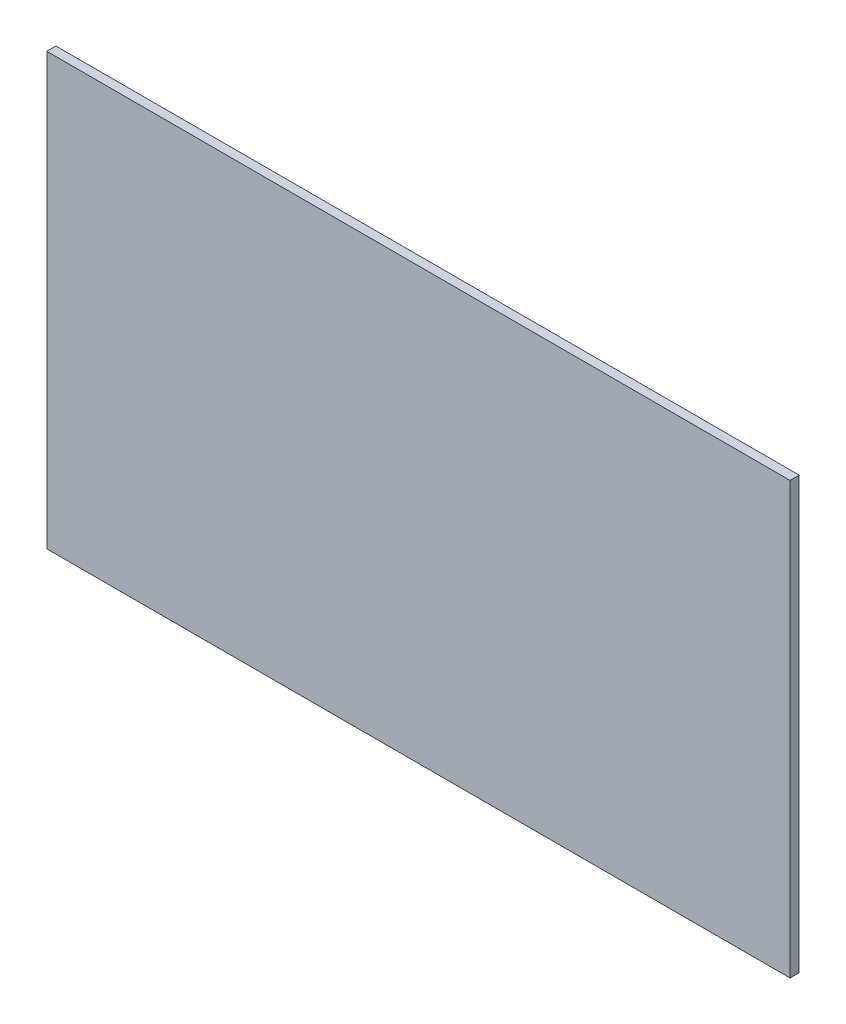
ISO-10303-21;
HEADER;
FILE_DESCRIPTION(('STEP AP214'),'2;1');
FILE_NAME('part.step','',(''),(''),'','','');
FILE_SCHEMA(('AUTOMOTIVE_DESIGN { 1 0 10303 214 1 1 1 1 }'));
ENDSEC;
DATA;
#1=APPLICATION_CONTEXT('core data for automotive mechanical design processes');
#2=APPLICATION_PROTOCOL_DEFINITION('international standard','automotive_design',2000,#1);
#3=PRODUCT_CONTEXT('',#1,'mechanical');
#4=PRODUCT('Part','Part','',(#3));
#5=PRODUCT_RELATED_PRODUCT_CATEGORY('part','',(#4));
#6=PRODUCT_DEFINITION_FORMATION('','',#4);
#7=PRODUCT_DEFINITION_CONTEXT('part definition',#1,'design');
#8=PRODUCT_DEFINITION('design','',#6,#7);
#9=PRODUCT_DEFINITION_SHAPE('','',#8);
#10=(LENGTH_UNIT() NAMED_UNIT(*) SI_UNIT(.MILLI.,.METRE.));
#11=(NAMED_UNIT(*) PLANE_ANGLE_UNIT() SI_UNIT($,.RADIAN.));
#12=(NAMED_UNIT(*) SI_UNIT($,.STERADIAN.) SOLID_ANGLE_UNIT());
#13=UNCERTAINTY_MEASURE_WITH_UNIT(LENGTH_MEASURE(1.E-05),#10,'distance_accuracy_value','');
#14=(GEOMETRIC_REPRESENTATION_CONTEXT(3) GLOBAL_UNCERTAINTY_ASSIGNED_CONTEXT((#13)) GLOBAL_UNIT_ASSIGNED_CONTEXT((#10,
#11,#12)) REPRESENTATION_CONTEXT('',''));
#15=CARTESIAN_POINT('',(0.,0.,0.));
#16=DIRECTION('',(0.,0.,1.));
#17=DIRECTION('',(1.,0.,0.));
#18=AXIS2_PLACEMENT_3D('',#15,#16,#17);
#19=CARTESIAN_POINT('',(4.00000000000002,0.,2.));
#20=DIRECTION('',(-1.,0.,0.));
#21=DIRECTION('',(0.,-1.,0.));
#22=AXIS2_PLACEMENT_3D('',#19,#20,#21);
#23=PLANE('',#22);
#24=DIRECTION('',(0.,1.,0.));
#25=VECTOR('',#24,1.);
#26=CARTESIAN_POINT('',(4.00000000000002,0.,0.));
#27=LINE('',#26,#25);
#28=CARTESIAN_POINT('',(4.00000000000002,-22.,0.));
#29=VERTEX_POINT('',#28);
#30=CARTESIAN_POINT('',(4.,72.5,0.));
#31=VERTEX_POINT('',#30);
#32=EDGE_CURVE('E109',#29,#31,#27,.T.);
#33=ORIENTED_EDGE('',*,*,#32,.T.);
#34=DIRECTION('',(0.,0.,-1.));
#35=VECTOR('',#34,1.);
#36=CARTESIAN_POINT('',(4.,72.5,2.));
#37=LINE('',#36,#35);
#38=CARTESIAN_POINT('',(4.,72.5,2.));
#39=VERTEX_POINT('',#38);
#40=EDGE_CURVE('E11',#39,#31,#37,.T.);
#41=ORIENTED_EDGE('',*,*,#40,.F.);
#42=DIRECTION('',(0.,1.,0.));
#43=VECTOR('',#42,1.);
#44=CARTESIAN_POINT('',(4.00000000000002,0.,2.));
#45=LINE('',#44,#43);
#46=CARTESIAN_POINT('',(4.00000000000002,-22.,2.));
#47=VERTEX_POINT('',#46);
#48=EDGE_CURVE('E91',#47,#39,#45,.T.);
#49=ORIENTED_EDGE('',*,*,#48,.F.);
#50=DIRECTION('',(0.,0.,-1.));
#51=VECTOR('',#50,1.);
#52=CARTESIAN_POINT('',(4.00000000000002,-22.,2.));
#53=LINE('',#52,#51);
#54=EDGE_CURVE('E58',#47,#29,#53,.T.);
#55=ORIENTED_EDGE('',*,*,#54,.T.);
#56=EDGE_LOOP('',(#33,#41,#49,#55));
#57=FACE_BOUND('',#56,.T.);
#58=ADVANCED_FACE('F41',(#57),#23,.F.);
#59=CARTESIAN_POINT('',(0.,72.5,2.));
#60=DIRECTION('',(0.,-1.,0.));
#61=DIRECTION('',(1.,0.,0.));
#62=AXIS2_PLACEMENT_3D('',#59,#60,#61);
#63=PLANE('',#62);
#64=DIRECTION('',(-1.,0.,0.));
#65=VECTOR('',#64,1.);
#66=CARTESIAN_POINT('',(0.,72.5,0.));
#67=LINE('',#66,#65);
#68=CARTESIAN_POINT('',(-159.,72.5,0.));
#69=VERTEX_POINT('',#68);
#70=EDGE_CURVE('E97',#31,#69,#67,.T.);
#71=ORIENTED_EDGE('',*,*,#70,.T.);
#72=DIRECTION('',(0.,0.,-1.));
#73=VECTOR('',#72,1.);
#74=CARTESIAN_POINT('',(-159.,72.5,2.));
#75=LINE('',#74,#73);
#76=CARTESIAN_POINT('',(-159.,72.5,2.));
#77=VERTEX_POINT('',#76);
#78=EDGE_CURVE('E50',#77,#69,#75,.T.);
#79=ORIENTED_EDGE('',*,*,#78,.F.);
#80=DIRECTION('',(-1.,0.,0.));
#81=VECTOR('',#80,1.);
#82=CARTESIAN_POINT('',(0.,72.5,2.));
#83=LINE('',#82,#81);
#84=EDGE_CURVE('E83',#39,#77,#83,.T.);
#85=ORIENTED_EDGE('',*,*,#84,.F.);
#86=ORIENTED_EDGE('',*,*,#40,.T.);
#87=EDGE_LOOP('',(#71,#79,#85,#86));
#88=FACE_BOUND('',#87,.T.);
#89=ADVANCED_FACE('F96',(#88),#63,.F.);
#90=CARTESIAN_POINT('',(-159.,0.,2.));
#91=DIRECTION('',(-1.,0.,0.));
#92=DIRECTION('',(0.,0.,1.));
#93=AXIS2_PLACEMENT_3D('',#90,#91,#92);
#94=PLANE('',#93);
#95=DIRECTION('',(0.,1.,0.));
#96=VECTOR('',#95,1.);
#97=CARTESIAN_POINT('',(-159.,0.,0.));
#98=LINE('',#97,#96);
#99=CARTESIAN_POINT('',(-159.,-22.,0.));
#100=VERTEX_POINT('',#99);
#101=EDGE_CURVE('E114',#100,#69,#98,.T.);
#102=ORIENTED_EDGE('',*,*,#101,.F.);
#103=DIRECTION('',(0.,0.,-1.));
#104=VECTOR('',#103,1.);
#105=CARTESIAN_POINT('',(-159.,-22.,2.));
#106=LINE('',#105,#104);
#107=CARTESIAN_POINT('',(-159.,-22.,2.));
#108=VERTEX_POINT('',#107);
#109=EDGE_CURVE('E72',#108,#100,#106,.T.);
#110=ORIENTED_EDGE('',*,*,#109,.F.);
#111=DIRECTION('',(0.,1.,0.));
#112=VECTOR('',#111,1.);
#113=CARTESIAN_POINT('',(-159.,0.,2.));
#114=LINE('',#113,#112);
#115=EDGE_CURVE('E90',#108,#77,#114,.T.);
#116=ORIENTED_EDGE('',*,*,#115,.T.);
#117=ORIENTED_EDGE('',*,*,#78,.T.);
#118=EDGE_LOOP('',(#102,#110,#116,#117));
#119=FACE_BOUND('',#118,.T.);
#120=ADVANCED_FACE('F101',(#119),#94,.T.);
#121=CARTESIAN_POINT('',(0.,-22.,2.));
#122=DIRECTION('',(0.,-1.,0.));
#123=DIRECTION('',(1.,0.,0.));
#124=AXIS2_PLACEMENT_3D('',#121,#122,#123);
#125=PLANE('',#124);
#126=DIRECTION('',(-1.,0.,0.));
#127=VECTOR('',#126,1.);
#128=CARTESIAN_POINT('',(0.,-22.,0.));
#129=LINE('',#128,#127);
#130=EDGE_CURVE('E117',#29,#100,#129,.T.);
#131=ORIENTED_EDGE('',*,*,#130,.F.);
#132=ORIENTED_EDGE('',*,*,#54,.F.);
#133=DIRECTION('',(-1.,0.,0.));
#134=VECTOR('',#133,1.);
#135=CARTESIAN_POINT('',(0.,-22.,2.));
#136=LINE('',#135,#134);
#137=EDGE_CURVE('E103',#47,#108,#136,.T.);
#138=ORIENTED_EDGE('',*,*,#137,.T.);
#139=ORIENTED_EDGE('',*,*,#109,.T.);
#140=EDGE_LOOP('',(#131,#132,#138,#139));
#141=FACE_BOUND('',#140,.T.);
#142=ADVANCED_FACE('F127',(#141),#125,.T.);
#143=CARTESIAN_POINT('',(0.,0.,2.));
#144=DIRECTION('',(0.,0.,1.));
#145=DIRECTION('',(1.,0.,0.));
#146=AXIS2_PLACEMENT_3D('',#143,#144,#145);
#147=PLANE('',#146);
#148=ORIENTED_EDGE('',*,*,#48,.T.);
#149=ORIENTED_EDGE('',*,*,#84,.T.);
#150=ORIENTED_EDGE('',*,*,#115,.F.);
#151=ORIENTED_EDGE('',*,*,#137,.F.);
#152=EDGE_LOOP('',(#148,#149,#150,#151));
#153=FACE_BOUND('',#152,.T.);
#154=ADVANCED_FACE('F87',(#153),#147,.T.);
#155=CARTESIAN_POINT('',(0.,0.,0.));
#156=DIRECTION('',(0.,0.,1.));
#157=DIRECTION('',(1.,0.,0.));
#158=AXIS2_PLACEMENT_3D('',#155,#156,#157);
#159=PLANE('',#158);
#160=ORIENTED_EDGE('',*,*,#32,.F.);
#161=ORIENTED_EDGE('',*,*,#130,.T.);
#162=ORIENTED_EDGE('',*,*,#101,.T.);
#163=ORIENTED_EDGE('',*,*,#70,.F.);
#164=EDGE_LOOP('',(#160,#161,#162,#163));
#165=FACE_BOUND('',#164,.T.);
#166=ADVANCED_FACE('F126',(#165),#159,.F.);
#167=CLOSED_SHELL('',(#58,#89,#120,#142,#154,#166));
#168=MANIFOLD_SOLID_BREP('B2',#167);
#169=ADVANCED_BREP_SHAPE_REPRESENTATION('',(#18,#168),#14);
#170=SHAPE_DEFINITION_REPRESENTATION(#9,#169);
ENDSEC;
END-ISO-10303-21;
